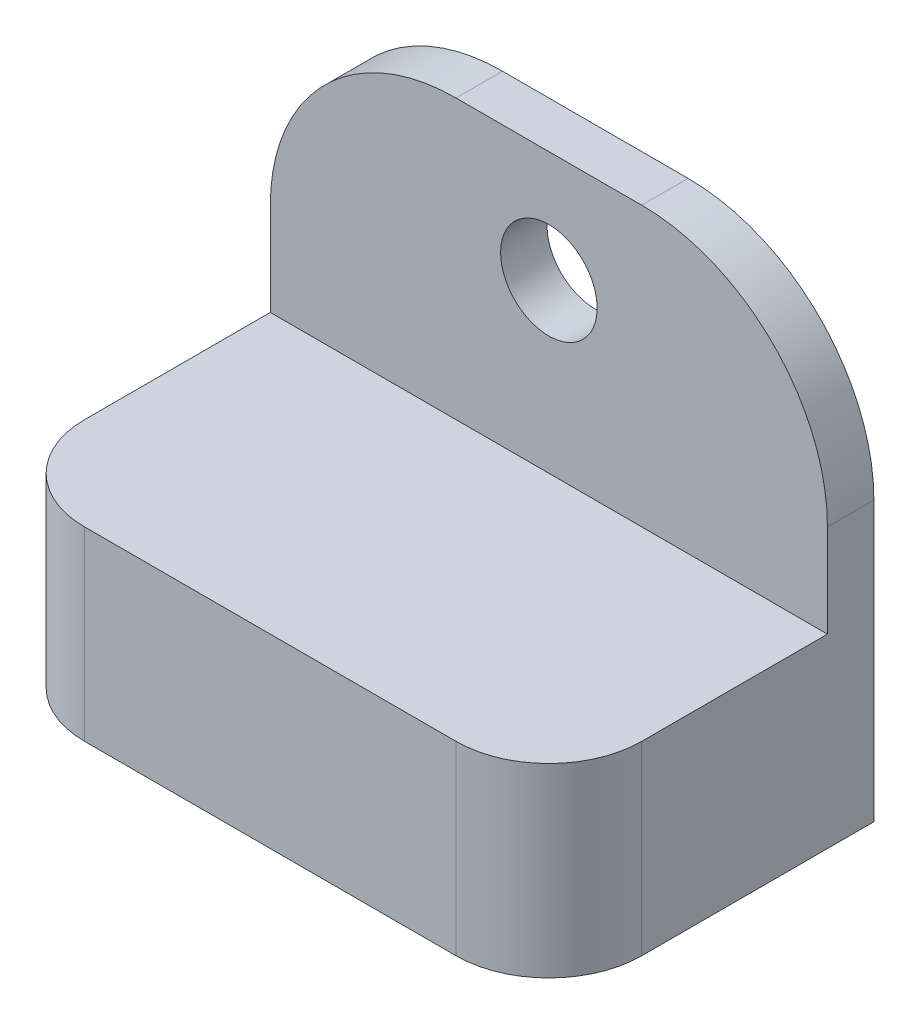
ISO-10303-21;
HEADER;
FILE_DESCRIPTION(('STEP AP214'),'2;1');
FILE_NAME('part.step','',(''),(''),'','','');
FILE_SCHEMA(('AUTOMOTIVE_DESIGN { 1 0 10303 214 1 1 1 1 }'));
ENDSEC;
DATA;
#1=APPLICATION_CONTEXT('core data for automotive mechanical design processes');
#2=APPLICATION_PROTOCOL_DEFINITION('international standard','automotive_design',2000,#1);
#3=PRODUCT_CONTEXT('',#1,'mechanical');
#4=PRODUCT('Part','Part','',(#3));
#5=PRODUCT_RELATED_PRODUCT_CATEGORY('part','',(#4));
#6=PRODUCT_DEFINITION_FORMATION('','',#4);
#7=PRODUCT_DEFINITION_CONTEXT('part definition',#1,'design');
#8=PRODUCT_DEFINITION('design','',#6,#7);
#9=PRODUCT_DEFINITION_SHAPE('','',#8);
#10=(LENGTH_UNIT() NAMED_UNIT(*) SI_UNIT(.MILLI.,.METRE.));
#11=(NAMED_UNIT(*) PLANE_ANGLE_UNIT() SI_UNIT($,.RADIAN.));
#12=(NAMED_UNIT(*) SI_UNIT($,.STERADIAN.) SOLID_ANGLE_UNIT());
#13=UNCERTAINTY_MEASURE_WITH_UNIT(LENGTH_MEASURE(1.E-05),#10,'distance_accuracy_value','');
#14=(GEOMETRIC_REPRESENTATION_CONTEXT(3) GLOBAL_UNCERTAINTY_ASSIGNED_CONTEXT((#13)) GLOBAL_UNIT_ASSIGNED_CONTEXT((#10,
#11,#12)) REPRESENTATION_CONTEXT('',''));
#15=CARTESIAN_POINT('',(0.,0.,0.));
#16=DIRECTION('',(0.,0.,1.));
#17=DIRECTION('',(1.,0.,0.));
#18=AXIS2_PLACEMENT_3D('',#15,#16,#17);
#19=CARTESIAN_POINT('',(38.1,31.75,0.));
#20=DIRECTION('',(0.,0.,1.));
#21=DIRECTION('',(0.,-1.,0.));
#22=AXIS2_PLACEMENT_3D('',#19,#20,#21);
#23=PLANE('',#22);
#24=CARTESIAN_POINT('',(19.05,24.13,0.));
#25=DIRECTION('',(0.,0.,-1.));
#26=DIRECTION('',(0.,1.,0.));
#27=AXIS2_PLACEMENT_3D('',#24,#25,#26);
#28=CIRCLE('',#27,3.302);
#29=CARTESIAN_POINT('',(19.05,27.432,0.));
#30=VERTEX_POINT('',#29);
#31=EDGE_CURVE('E187',#30,#30,#28,.T.);
#32=ORIENTED_EDGE('',*,*,#31,.F.);
#33=EDGE_LOOP('',(#32));
#34=FACE_BOUND('',#33,.T.);
#35=DIRECTION('',(-1.,0.,0.));
#36=VECTOR('',#35,1.);
#37=CARTESIAN_POINT('',(38.1,31.75,0.));
#38=LINE('',#37,#36);
#39=CARTESIAN_POINT('',(25.4,31.75,0.));
#40=VERTEX_POINT('',#39);
#41=CARTESIAN_POINT('',(12.7,31.75,0.));
#42=VERTEX_POINT('',#41);
#43=EDGE_CURVE('E180',#40,#42,#38,.T.);
#44=ORIENTED_EDGE('',*,*,#43,.F.);
#45=CARTESIAN_POINT('',(25.4,19.05,0.));
#46=DIRECTION('',(0.,0.,1.));
#47=DIRECTION('',(0.,-1.,0.));
#48=AXIS2_PLACEMENT_3D('',#45,#46,#47);
#49=CIRCLE('',#48,12.7);
#50=CARTESIAN_POINT('',(38.1,19.05,0.));
#51=VERTEX_POINT('',#50);
#52=EDGE_CURVE('E47',#40,#51,#49,.F.);
#53=ORIENTED_EDGE('',*,*,#52,.T.);
#54=DIRECTION('',(0.,1.,0.));
#55=VECTOR('',#54,1.);
#56=CARTESIAN_POINT('',(38.1,31.75,0.));
#57=LINE('',#56,#55);
#58=CARTESIAN_POINT('',(38.1,0.,0.));
#59=VERTEX_POINT('',#58);
#60=EDGE_CURVE('E130',#59,#51,#57,.T.);
#61=ORIENTED_EDGE('',*,*,#60,.F.);
#62=DIRECTION('',(-1.,0.,0.));
#63=VECTOR('',#62,1.);
#64=CARTESIAN_POINT('',(38.1,0.,0.));
#65=LINE('',#64,#63);
#66=CARTESIAN_POINT('',(0.,0.,0.));
#67=VERTEX_POINT('',#66);
#68=EDGE_CURVE('E151',#59,#67,#65,.T.);
#69=ORIENTED_EDGE('',*,*,#68,.T.);
#70=DIRECTION('',(0.,1.,0.));
#71=VECTOR('',#70,1.);
#72=CARTESIAN_POINT('',(0.,31.75,0.));
#73=LINE('',#72,#71);
#74=CARTESIAN_POINT('',(0.,19.05,0.));
#75=VERTEX_POINT('',#74);
#76=EDGE_CURVE('E155',#67,#75,#73,.T.);
#77=ORIENTED_EDGE('',*,*,#76,.T.);
#78=CARTESIAN_POINT('',(12.7,19.05,0.));
#79=DIRECTION('',(0.,0.,1.));
#80=DIRECTION('',(0.,-1.,0.));
#81=AXIS2_PLACEMENT_3D('',#78,#79,#80);
#82=CIRCLE('',#81,12.7);
#83=EDGE_CURVE('E59',#75,#42,#82,.F.);
#84=ORIENTED_EDGE('',*,*,#83,.T.);
#85=EDGE_LOOP('',(#44,#53,#61,#69,#77,#84));
#86=FACE_BOUND('',#85,.T.);
#87=ADVANCED_FACE('F38',(#34,#86),#23,.F.);
#88=CARTESIAN_POINT('',(38.1,31.75,3.17500000000001));
#89=DIRECTION('',(0.,-1.,0.));
#90=DIRECTION('',(0.,0.,-1.));
#91=AXIS2_PLACEMENT_3D('',#88,#89,#90);
#92=PLANE('',#91);
#93=DIRECTION('',(-1.,0.,0.));
#94=VECTOR('',#93,1.);
#95=CARTESIAN_POINT('',(38.1,31.75,3.17500000000001));
#96=LINE('',#95,#94);
#97=CARTESIAN_POINT('',(25.4,31.75,3.17500000000001));
#98=VERTEX_POINT('',#97);
#99=CARTESIAN_POINT('',(12.7,31.75,3.17500000000001));
#100=VERTEX_POINT('',#99);
#101=EDGE_CURVE('E140',#98,#100,#96,.T.);
#102=ORIENTED_EDGE('',*,*,#101,.F.);
#103=DIRECTION('',(0.,0.,1.));
#104=VECTOR('',#103,1.);
#105=CARTESIAN_POINT('',(25.4,31.75,3.17500000000001));
#106=LINE('',#105,#104);
#107=EDGE_CURVE('E223',#98,#40,#106,.F.);
#108=ORIENTED_EDGE('',*,*,#107,.T.);
#109=ORIENTED_EDGE('',*,*,#43,.T.);
#110=DIRECTION('',(0.,0.,1.));
#111=VECTOR('',#110,1.);
#112=CARTESIAN_POINT('',(12.7,31.75,3.17500000000001));
#113=LINE('',#112,#111);
#114=EDGE_CURVE('E219',#42,#100,#113,.T.);
#115=ORIENTED_EDGE('',*,*,#114,.T.);
#116=EDGE_LOOP('',(#102,#108,#109,#115));
#117=FACE_BOUND('',#116,.T.);
#118=ADVANCED_FACE('F238',(#117),#92,.F.);
#119=CARTESIAN_POINT('',(38.1,12.7,3.17500000000001));
#120=DIRECTION('',(0.,0.,-1.));
#121=DIRECTION('',(-1.,0.,0.));
#122=AXIS2_PLACEMENT_3D('',#119,#120,#121);
#123=PLANE('',#122);
#124=CARTESIAN_POINT('',(19.05,24.13,3.17500000000001));
#125=DIRECTION('',(0.,0.,-1.));
#126=DIRECTION('',(-1.,0.,0.));
#127=AXIS2_PLACEMENT_3D('',#124,#125,#126);
#128=CIRCLE('',#127,3.302);
#129=CARTESIAN_POINT('',(15.748,24.13,3.17500000000001));
#130=VERTEX_POINT('',#129);
#131=EDGE_CURVE('E158',#130,#130,#128,.T.);
#132=ORIENTED_EDGE('',*,*,#131,.T.);
#133=EDGE_LOOP('',(#132));
#134=FACE_BOUND('',#133,.T.);
#135=DIRECTION('',(0.,-1.,0.));
#136=VECTOR('',#135,1.);
#137=CARTESIAN_POINT('',(38.1,12.7,3.17500000000001));
#138=LINE('',#137,#136);
#139=CARTESIAN_POINT('',(38.1,19.05,3.17500000000001));
#140=VERTEX_POINT('',#139);
#141=CARTESIAN_POINT('',(38.1,12.7,3.17500000000001));
#142=VERTEX_POINT('',#141);
#143=EDGE_CURVE('E118',#140,#142,#138,.T.);
#144=ORIENTED_EDGE('',*,*,#143,.F.);
#145=CARTESIAN_POINT('',(25.4,19.05,3.17500000000001));
#146=DIRECTION('',(0.,0.,-1.));
#147=DIRECTION('',(-1.,0.,0.));
#148=AXIS2_PLACEMENT_3D('',#145,#146,#147);
#149=CIRCLE('',#148,12.7);
#150=EDGE_CURVE('E216',#140,#98,#149,.F.);
#151=ORIENTED_EDGE('',*,*,#150,.T.);
#152=ORIENTED_EDGE('',*,*,#101,.T.);
#153=CARTESIAN_POINT('',(12.7,19.05,3.17500000000001));
#154=DIRECTION('',(0.,0.,-1.));
#155=DIRECTION('',(-1.,0.,0.));
#156=AXIS2_PLACEMENT_3D('',#153,#154,#155);
#157=CIRCLE('',#156,12.7);
#158=CARTESIAN_POINT('',(0.,19.05,3.17500000000001));
#159=VERTEX_POINT('',#158);
#160=EDGE_CURVE('E213',#100,#159,#157,.F.);
#161=ORIENTED_EDGE('',*,*,#160,.T.);
#162=DIRECTION('',(0.,-1.,0.));
#163=VECTOR('',#162,1.);
#164=CARTESIAN_POINT('',(0.,12.7,3.17500000000001));
#165=LINE('',#164,#163);
#166=CARTESIAN_POINT('',(0.,12.7,3.17500000000001));
#167=VERTEX_POINT('',#166);
#168=EDGE_CURVE('E135',#159,#167,#165,.T.);
#169=ORIENTED_EDGE('',*,*,#168,.T.);
#170=DIRECTION('',(-1.,0.,0.));
#171=VECTOR('',#170,1.);
#172=CARTESIAN_POINT('',(38.1,12.7,3.17500000000001));
#173=LINE('',#172,#171);
#174=EDGE_CURVE('E133',#142,#167,#173,.T.);
#175=ORIENTED_EDGE('',*,*,#174,.F.);
#176=EDGE_LOOP('',(#144,#151,#152,#161,#169,#175));
#177=FACE_BOUND('',#176,.T.);
#178=ADVANCED_FACE('F134',(#134,#177),#123,.F.);
#179=CARTESIAN_POINT('',(38.1,12.7,22.225));
#180=DIRECTION('',(0.,-1.,0.));
#181=DIRECTION('',(0.,0.,-1.));
#182=AXIS2_PLACEMENT_3D('',#179,#180,#181);
#183=PLANE('',#182);
#184=DIRECTION('',(-1.,0.,0.));
#185=VECTOR('',#184,1.);
#186=CARTESIAN_POINT('',(38.1,12.7,22.225));
#187=LINE('',#186,#185);
#188=CARTESIAN_POINT('',(31.75,12.7,22.225));
#189=VERTEX_POINT('',#188);
#190=CARTESIAN_POINT('',(6.35000000000002,12.7,22.225));
#191=VERTEX_POINT('',#190);
#192=EDGE_CURVE('E141',#189,#191,#187,.T.);
#193=ORIENTED_EDGE('',*,*,#192,.F.);
#194=CARTESIAN_POINT('',(31.75,12.7,15.875));
#195=DIRECTION('',(0.,-1.,0.));
#196=DIRECTION('',(0.,0.,-1.));
#197=AXIS2_PLACEMENT_3D('',#194,#195,#196);
#198=CIRCLE('',#197,6.35);
#199=CARTESIAN_POINT('',(38.1,12.7,15.875));
#200=VERTEX_POINT('',#199);
#201=EDGE_CURVE('E146',#189,#200,#198,.F.);
#202=ORIENTED_EDGE('',*,*,#201,.T.);
#203=DIRECTION('',(0.,0.,1.));
#204=VECTOR('',#203,1.);
#205=CARTESIAN_POINT('',(38.1,12.7,22.225));
#206=LINE('',#205,#204);
#207=EDGE_CURVE('E124',#142,#200,#206,.T.);
#208=ORIENTED_EDGE('',*,*,#207,.F.);
#209=ORIENTED_EDGE('',*,*,#174,.T.);
#210=DIRECTION('',(0.,0.,1.));
#211=VECTOR('',#210,1.);
#212=CARTESIAN_POINT('',(0.,12.7,22.225));
#213=LINE('',#212,#211);
#214=CARTESIAN_POINT('',(0.,12.7,15.875));
#215=VERTEX_POINT('',#214);
#216=EDGE_CURVE('E161',#167,#215,#213,.T.);
#217=ORIENTED_EDGE('',*,*,#216,.T.);
#218=CARTESIAN_POINT('',(6.35,12.7,15.875));
#219=DIRECTION('',(0.,-1.,0.));
#220=DIRECTION('',(0.,0.,-1.));
#221=AXIS2_PLACEMENT_3D('',#218,#219,#220);
#222=CIRCLE('',#221,6.35);
#223=EDGE_CURVE('E203',#215,#191,#222,.F.);
#224=ORIENTED_EDGE('',*,*,#223,.T.);
#225=EDGE_LOOP('',(#193,#202,#208,#209,#217,#224));
#226=FACE_BOUND('',#225,.T.);
#227=ADVANCED_FACE('F144',(#226),#183,.F.);
#228=CARTESIAN_POINT('',(38.1,0.,22.225));
#229=DIRECTION('',(0.,0.,-1.));
#230=DIRECTION('',(-1.,0.,0.));
#231=AXIS2_PLACEMENT_3D('',#228,#229,#230);
#232=PLANE('',#231);
#233=DIRECTION('',(-1.,0.,0.));
#234=VECTOR('',#233,1.);
#235=CARTESIAN_POINT('',(38.1,0.,22.225));
#236=LINE('',#235,#234);
#237=CARTESIAN_POINT('',(31.75,0.,22.225));
#238=VERTEX_POINT('',#237);
#239=CARTESIAN_POINT('',(6.35000000000002,0.,22.225));
#240=VERTEX_POINT('',#239);
#241=EDGE_CURVE('E170',#238,#240,#236,.T.);
#242=ORIENTED_EDGE('',*,*,#241,.F.);
#243=DIRECTION('',(0.,-1.,0.));
#244=VECTOR('',#243,1.);
#245=CARTESIAN_POINT('',(31.75,0.,22.225));
#246=LINE('',#245,#244);
#247=EDGE_CURVE('E200',#238,#189,#246,.F.);
#248=ORIENTED_EDGE('',*,*,#247,.T.);
#249=ORIENTED_EDGE('',*,*,#192,.T.);
#250=DIRECTION('',(0.,-1.,0.));
#251=VECTOR('',#250,1.);
#252=CARTESIAN_POINT('',(6.35,0.,22.225));
#253=LINE('',#252,#251);
#254=EDGE_CURVE('E196',#191,#240,#253,.T.);
#255=ORIENTED_EDGE('',*,*,#254,.T.);
#256=EDGE_LOOP('',(#242,#248,#249,#255));
#257=FACE_BOUND('',#256,.T.);
#258=ADVANCED_FACE('F250',(#257),#232,.F.);
#259=CARTESIAN_POINT('',(38.1,0.,0.));
#260=DIRECTION('',(0.,1.,0.));
#261=DIRECTION('',(0.,0.,1.));
#262=AXIS2_PLACEMENT_3D('',#259,#260,#261);
#263=PLANE('',#262);
#264=DIRECTION('',(0.,0.,-1.));
#265=VECTOR('',#264,1.);
#266=CARTESIAN_POINT('',(38.1,0.,0.));
#267=LINE('',#266,#265);
#268=CARTESIAN_POINT('',(38.1,0.,15.875));
#269=VERTEX_POINT('',#268);
#270=EDGE_CURVE('E148',#269,#59,#267,.T.);
#271=ORIENTED_EDGE('',*,*,#270,.F.);
#272=CARTESIAN_POINT('',(31.75,0.,15.875));
#273=DIRECTION('',(0.,1.,0.));
#274=DIRECTION('',(0.,0.,1.));
#275=AXIS2_PLACEMENT_3D('',#272,#273,#274);
#276=CIRCLE('',#275,6.35);
#277=EDGE_CURVE('E193',#269,#238,#276,.F.);
#278=ORIENTED_EDGE('',*,*,#277,.T.);
#279=ORIENTED_EDGE('',*,*,#241,.T.);
#280=CARTESIAN_POINT('',(6.35,0.,15.875));
#281=DIRECTION('',(0.,1.,0.));
#282=DIRECTION('',(0.,0.,1.));
#283=AXIS2_PLACEMENT_3D('',#280,#281,#282);
#284=CIRCLE('',#283,6.35);
#285=CARTESIAN_POINT('',(0.,0.,15.875));
#286=VERTEX_POINT('',#285);
#287=EDGE_CURVE('E190',#240,#286,#284,.F.);
#288=ORIENTED_EDGE('',*,*,#287,.T.);
#289=DIRECTION('',(0.,0.,-1.));
#290=VECTOR('',#289,1.);
#291=CARTESIAN_POINT('',(0.,0.,0.));
#292=LINE('',#291,#290);
#293=EDGE_CURVE('E164',#286,#67,#292,.T.);
#294=ORIENTED_EDGE('',*,*,#293,.T.);
#295=ORIENTED_EDGE('',*,*,#68,.F.);
#296=EDGE_LOOP('',(#271,#278,#279,#288,#294,#295));
#297=FACE_BOUND('',#296,.T.);
#298=ADVANCED_FACE('F253',(#297),#263,.F.);
#299=CARTESIAN_POINT('',(38.1,0.,0.));
#300=DIRECTION('',(-1.,0.,0.));
#301=DIRECTION('',(0.,0.,1.));
#302=AXIS2_PLACEMENT_3D('',#299,#300,#301);
#303=PLANE('',#302);
#304=ORIENTED_EDGE('',*,*,#60,.T.);
#305=DIRECTION('',(0.,0.,1.));
#306=VECTOR('',#305,1.);
#307=CARTESIAN_POINT('',(38.1,19.05,0.));
#308=LINE('',#307,#306);
#309=EDGE_CURVE('E127',#51,#140,#308,.T.);
#310=ORIENTED_EDGE('',*,*,#309,.T.);
#311=ORIENTED_EDGE('',*,*,#143,.T.);
#312=ORIENTED_EDGE('',*,*,#207,.T.);
#313=DIRECTION('',(0.,-1.,0.));
#314=VECTOR('',#313,1.);
#315=CARTESIAN_POINT('',(38.1,0.,15.875));
#316=LINE('',#315,#314);
#317=EDGE_CURVE('E183',#200,#269,#316,.T.);
#318=ORIENTED_EDGE('',*,*,#317,.T.);
#319=ORIENTED_EDGE('',*,*,#270,.T.);
#320=EDGE_LOOP('',(#304,#310,#311,#312,#318,#319));
#321=FACE_BOUND('',#320,.T.);
#322=ADVANCED_FACE('F121',(#321),#303,.F.);
#323=CARTESIAN_POINT('',(0.,0.,0.));
#324=DIRECTION('',(-1.,0.,0.));
#325=DIRECTION('',(0.,0.,1.));
#326=AXIS2_PLACEMENT_3D('',#323,#324,#325);
#327=PLANE('',#326);
#328=ORIENTED_EDGE('',*,*,#168,.F.);
#329=DIRECTION('',(0.,0.,1.));
#330=VECTOR('',#329,1.);
#331=CARTESIAN_POINT('',(0.,19.05,0.));
#332=LINE('',#331,#330);
#333=EDGE_CURVE('E11',#159,#75,#332,.F.);
#334=ORIENTED_EDGE('',*,*,#333,.T.);
#335=ORIENTED_EDGE('',*,*,#76,.F.);
#336=ORIENTED_EDGE('',*,*,#293,.F.);
#337=DIRECTION('',(0.,-1.,0.));
#338=VECTOR('',#337,1.);
#339=CARTESIAN_POINT('',(0.,12.7,15.875));
#340=LINE('',#339,#338);
#341=EDGE_CURVE('E208',#286,#215,#340,.F.);
#342=ORIENTED_EDGE('',*,*,#341,.T.);
#343=ORIENTED_EDGE('',*,*,#216,.F.);
#344=EDGE_LOOP('',(#328,#334,#335,#336,#342,#343));
#345=FACE_BOUND('',#344,.T.);
#346=ADVANCED_FACE('F241',(#345),#327,.T.);
#347=CARTESIAN_POINT('',(19.05,24.13,22.225));
#348=DIRECTION('',(0.,0.,-1.));
#349=DIRECTION('',(0.,1.,0.));
#350=AXIS2_PLACEMENT_3D('',#347,#348,#349);
#351=CYLINDRICAL_SURFACE('',#350,3.302);
#352=ORIENTED_EDGE('',*,*,#31,.T.);
#353=EDGE_LOOP('',(#352));
#354=FACE_BOUND('',#353,.T.);
#355=ORIENTED_EDGE('',*,*,#131,.F.);
#356=EDGE_LOOP('',(#355));
#357=FACE_BOUND('',#356,.T.);
#358=ADVANCED_FACE('F257',(#354,#357),#351,.F.);
#359=CARTESIAN_POINT('',(31.75,0.,15.875));
#360=DIRECTION('',(0.,-1.,0.));
#361=DIRECTION('',(0.,0.,-1.));
#362=AXIS2_PLACEMENT_3D('',#359,#360,#361);
#363=CYLINDRICAL_SURFACE('',#362,6.35);
#364=ORIENTED_EDGE('',*,*,#201,.F.);
#365=ORIENTED_EDGE('',*,*,#247,.F.);
#366=ORIENTED_EDGE('',*,*,#277,.F.);
#367=ORIENTED_EDGE('',*,*,#317,.F.);
#368=EDGE_LOOP('',(#364,#365,#366,#367));
#369=FACE_BOUND('',#368,.T.);
#370=ADVANCED_FACE('F255',(#369),#363,.T.);
#371=CARTESIAN_POINT('',(6.35,0.,15.875));
#372=DIRECTION('',(0.,1.,0.));
#373=DIRECTION('',(0.,0.,1.));
#374=AXIS2_PLACEMENT_3D('',#371,#372,#373);
#375=CYLINDRICAL_SURFACE('',#374,6.35);
#376=ORIENTED_EDGE('',*,*,#223,.F.);
#377=ORIENTED_EDGE('',*,*,#341,.F.);
#378=ORIENTED_EDGE('',*,*,#287,.F.);
#379=ORIENTED_EDGE('',*,*,#254,.F.);
#380=EDGE_LOOP('',(#376,#377,#378,#379));
#381=FACE_BOUND('',#380,.T.);
#382=ADVANCED_FACE('F247',(#381),#375,.T.);
#383=CARTESIAN_POINT('',(25.4,19.05,0.));
#384=DIRECTION('',(0.,0.,1.));
#385=DIRECTION('',(1.,0.,0.));
#386=AXIS2_PLACEMENT_3D('',#383,#384,#385);
#387=CYLINDRICAL_SURFACE('',#386,12.7);
#388=ORIENTED_EDGE('',*,*,#52,.F.);
#389=ORIENTED_EDGE('',*,*,#107,.F.);
#390=ORIENTED_EDGE('',*,*,#150,.F.);
#391=ORIENTED_EDGE('',*,*,#309,.F.);
#392=EDGE_LOOP('',(#388,#389,#390,#391));
#393=FACE_BOUND('',#392,.T.);
#394=ADVANCED_FACE('F235',(#393),#387,.T.);
#395=CARTESIAN_POINT('',(12.7,19.05,3.17500000000001));
#396=DIRECTION('',(0.,0.,-1.));
#397=DIRECTION('',(-1.,0.,0.));
#398=AXIS2_PLACEMENT_3D('',#395,#396,#397);
#399=CYLINDRICAL_SURFACE('',#398,12.7);
#400=ORIENTED_EDGE('',*,*,#83,.F.);
#401=ORIENTED_EDGE('',*,*,#333,.F.);
#402=ORIENTED_EDGE('',*,*,#160,.F.);
#403=ORIENTED_EDGE('',*,*,#114,.F.);
#404=EDGE_LOOP('',(#400,#401,#402,#403));
#405=FACE_BOUND('',#404,.T.);
#406=ADVANCED_FACE('F40',(#405),#399,.T.);
#407=CLOSED_SHELL('',(#87,#118,#178,#227,#258,#298,#322,#346,#358,#370,#382,#394,#406));
#408=MANIFOLD_SOLID_BREP('B2',#407);
#409=ADVANCED_BREP_SHAPE_REPRESENTATION('',(#18,#408),#14);
#410=SHAPE_DEFINITION_REPRESENTATION(#9,#409);
ENDSEC;
END-ISO-10303-21;
